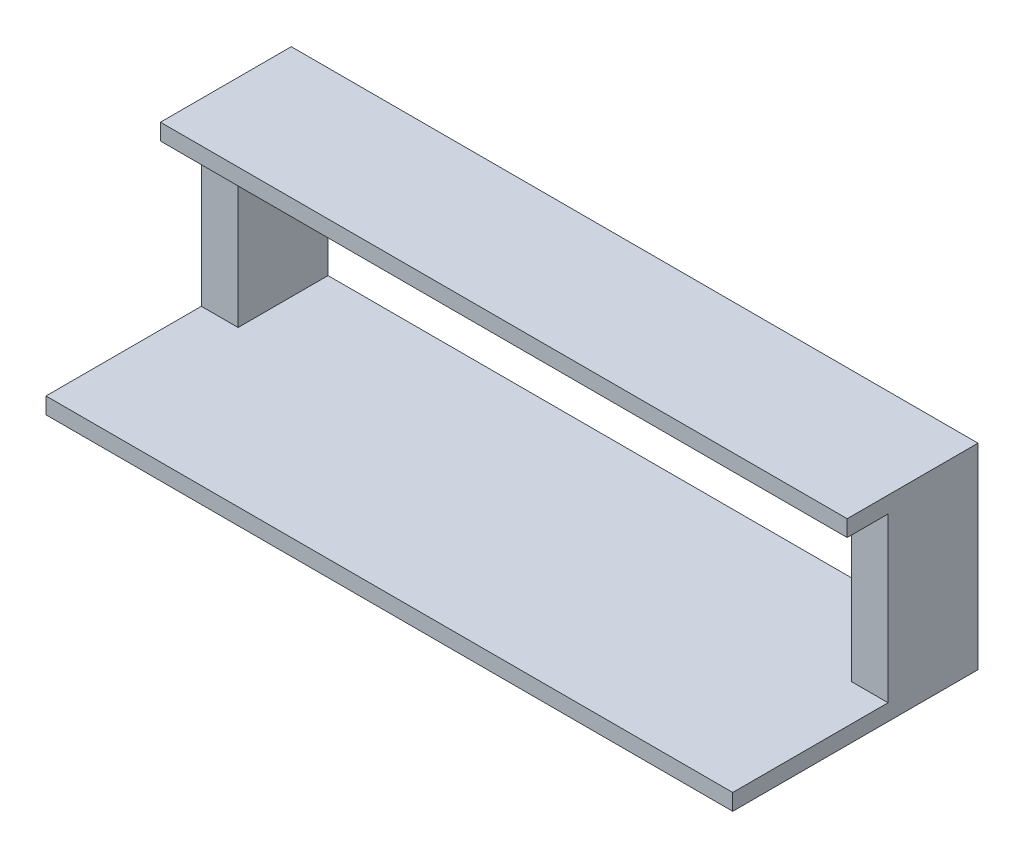
ISO-10303-21;
HEADER;
FILE_DESCRIPTION(('STEP AP214'),'2;1');
FILE_NAME('part.step','',(''),(''),'','','');
FILE_SCHEMA(('AUTOMOTIVE_DESIGN { 1 0 10303 214 1 1 1 1 }'));
ENDSEC;
DATA;
#1=APPLICATION_CONTEXT('core data for automotive mechanical design processes');
#2=APPLICATION_PROTOCOL_DEFINITION('international standard','automotive_design',2000,#1);
#3=PRODUCT_CONTEXT('',#1,'mechanical');
#4=PRODUCT('Part','Part','',(#3));
#5=PRODUCT_RELATED_PRODUCT_CATEGORY('part','',(#4));
#6=PRODUCT_DEFINITION_FORMATION('','',#4);
#7=PRODUCT_DEFINITION_CONTEXT('part definition',#1,'design');
#8=PRODUCT_DEFINITION('design','',#6,#7);
#9=PRODUCT_DEFINITION_SHAPE('','',#8);
#10=(LENGTH_UNIT() NAMED_UNIT(*) SI_UNIT(.MILLI.,.METRE.));
#11=(NAMED_UNIT(*) PLANE_ANGLE_UNIT() SI_UNIT($,.RADIAN.));
#12=(NAMED_UNIT(*) SI_UNIT($,.STERADIAN.) SOLID_ANGLE_UNIT());
#13=UNCERTAINTY_MEASURE_WITH_UNIT(LENGTH_MEASURE(1.E-05),#10,'distance_accuracy_value','');
#14=(GEOMETRIC_REPRESENTATION_CONTEXT(3) GLOBAL_UNCERTAINTY_ASSIGNED_CONTEXT((#13)) GLOBAL_UNIT_ASSIGNED_CONTEXT((#10,
#11,#12)) REPRESENTATION_CONTEXT('',''));
#15=CARTESIAN_POINT('',(0.,0.,0.));
#16=DIRECTION('',(0.,0.,1.));
#17=DIRECTION('',(1.,0.,0.));
#18=AXIS2_PLACEMENT_3D('',#15,#16,#17);
#19=CARTESIAN_POINT('',(-1066.8,558.8,-101.6));
#20=DIRECTION('',(0.,0.,-1.));
#21=DIRECTION('',(-1.,0.,0.));
#22=AXIS2_PLACEMENT_3D('',#19,#20,#21);
#23=PLANE('',#22);
#24=DIRECTION('',(1.,0.,0.));
#25=VECTOR('',#24,1.);
#26=CARTESIAN_POINT('',(-1066.8,558.8,-101.6));
#27=LINE('',#26,#25);
#28=CARTESIAN_POINT('',(-1066.8,558.8,-101.6));
#29=VERTEX_POINT('',#28);
#30=CARTESIAN_POINT('',(-952.5,558.8,-101.6));
#31=VERTEX_POINT('',#30);
#32=EDGE_CURVE('E147',#29,#31,#27,.T.);
#33=ORIENTED_EDGE('',*,*,#32,.F.);
#34=DIRECTION('',(0.,-1.,0.));
#35=VECTOR('',#34,1.);
#36=CARTESIAN_POINT('',(-1066.8,558.8,-101.6));
#37=LINE('',#36,#35);
#38=CARTESIAN_POINT('',(-1066.8,50.8,-101.6));
#39=VERTEX_POINT('',#38);
#40=EDGE_CURVE('E152',#29,#39,#37,.T.);
#41=ORIENTED_EDGE('',*,*,#40,.T.);
#42=DIRECTION('',(1.,0.,0.));
#43=VECTOR('',#42,1.);
#44=CARTESIAN_POINT('',(-1066.8,50.8,-101.6));
#45=LINE('',#44,#43);
#46=CARTESIAN_POINT('',(-952.5,50.8,-101.6));
#47=VERTEX_POINT('',#46);
#48=EDGE_CURVE('E180',#39,#47,#45,.T.);
#49=ORIENTED_EDGE('',*,*,#48,.T.);
#50=DIRECTION('',(0.,-1.,0.));
#51=VECTOR('',#50,1.);
#52=CARTESIAN_POINT('',(-952.5,558.8,-101.6));
#53=LINE('',#52,#51);
#54=EDGE_CURVE('E192',#31,#47,#53,.T.);
#55=ORIENTED_EDGE('',*,*,#54,.F.);
#56=EDGE_LOOP('',(#33,#41,#49,#55));
#57=FACE_BOUND('',#56,.T.);
#58=ADVANCED_FACE('F35',(#57),#23,.F.);
#59=CARTESIAN_POINT('',(952.499999999999,558.8,-101.6));
#60=VERTEX_POINT('',#59);
#61=CARTESIAN_POINT('',(1066.8,558.8,-101.6));
#62=VERTEX_POINT('',#61);
#63=EDGE_CURVE('E235',#60,#62,#27,.T.);
#64=ORIENTED_EDGE('',*,*,#63,.F.);
#65=DIRECTION('',(0.,-1.,0.));
#66=VECTOR('',#65,1.);
#67=CARTESIAN_POINT('',(952.5,558.8,-101.6));
#68=LINE('',#67,#66);
#69=CARTESIAN_POINT('',(952.5,50.8,-101.6));
#70=VERTEX_POINT('',#69);
#71=EDGE_CURVE('E174',#60,#70,#68,.T.);
#72=ORIENTED_EDGE('',*,*,#71,.T.);
#73=DIRECTION('',(1.,0.,0.));
#74=VECTOR('',#73,1.);
#75=CARTESIAN_POINT('',(1066.8,50.8,-101.6));
#76=LINE('',#75,#74);
#77=CARTESIAN_POINT('',(1066.8,50.8,-101.6));
#78=VERTEX_POINT('',#77);
#79=EDGE_CURVE('E50',#70,#78,#76,.T.);
#80=ORIENTED_EDGE('',*,*,#79,.T.);
#81=DIRECTION('',(0.,-1.,0.));
#82=VECTOR('',#81,1.);
#83=CARTESIAN_POINT('',(1066.8,558.8,-101.6));
#84=LINE('',#83,#82);
#85=EDGE_CURVE('E58',#62,#78,#84,.T.);
#86=ORIENTED_EDGE('',*,*,#85,.F.);
#87=EDGE_LOOP('',(#64,#72,#80,#86));
#88=FACE_BOUND('',#87,.T.);
#89=ADVANCED_FACE('F233',(#88),#23,.F.);
#90=CARTESIAN_POINT('',(0.,50.8,0.));
#91=DIRECTION('',(0.,-1.,0.));
#92=DIRECTION('',(0.,0.,-1.));
#93=AXIS2_PLACEMENT_3D('',#90,#91,#92);
#94=PLANE('',#93);
#95=DIRECTION('',(0.,0.,1.));
#96=VECTOR('',#95,1.);
#97=CARTESIAN_POINT('',(952.5,50.8,-381.));
#98=LINE('',#97,#96);
#99=CARTESIAN_POINT('',(952.5,50.8,-381.));
#100=VERTEX_POINT('',#99);
#101=EDGE_CURVE('E167',#100,#70,#98,.T.);
#102=ORIENTED_EDGE('',*,*,#101,.F.);
#103=DIRECTION('',(-1.,0.,0.));
#104=VECTOR('',#103,1.);
#105=CARTESIAN_POINT('',(-1066.8,50.8,-381.));
#106=LINE('',#105,#104);
#107=CARTESIAN_POINT('',(-952.5,50.8,-381.));
#108=VERTEX_POINT('',#107);
#109=EDGE_CURVE('E199',#100,#108,#106,.T.);
#110=ORIENTED_EDGE('',*,*,#109,.T.);
#111=DIRECTION('',(0.,0.,-1.));
#112=VECTOR('',#111,1.);
#113=CARTESIAN_POINT('',(-952.5,50.8,-381.));
#114=LINE('',#113,#112);
#115=EDGE_CURVE('E185',#47,#108,#114,.T.);
#116=ORIENTED_EDGE('',*,*,#115,.F.);
#117=ORIENTED_EDGE('',*,*,#48,.F.);
#118=DIRECTION('',(0.,0.,1.));
#119=VECTOR('',#118,1.);
#120=CARTESIAN_POINT('',(-1066.8,50.8,381.));
#121=LINE('',#120,#119);
#122=CARTESIAN_POINT('',(-1066.8,50.8,381.));
#123=VERTEX_POINT('',#122);
#124=EDGE_CURVE('E202',#39,#123,#121,.T.);
#125=ORIENTED_EDGE('',*,*,#124,.T.);
#126=DIRECTION('',(1.,0.,0.));
#127=VECTOR('',#126,1.);
#128=CARTESIAN_POINT('',(-1066.8,50.8,381.));
#129=LINE('',#128,#127);
#130=CARTESIAN_POINT('',(1066.8,50.8,381.));
#131=VERTEX_POINT('',#130);
#132=EDGE_CURVE('E204',#123,#131,#129,.T.);
#133=ORIENTED_EDGE('',*,*,#132,.T.);
#134=DIRECTION('',(0.,0.,-1.));
#135=VECTOR('',#134,1.);
#136=CARTESIAN_POINT('',(1066.8,50.8,381.));
#137=LINE('',#136,#135);
#138=EDGE_CURVE('E197',#131,#78,#137,.T.);
#139=ORIENTED_EDGE('',*,*,#138,.T.);
#140=ORIENTED_EDGE('',*,*,#79,.F.);
#141=EDGE_LOOP('',(#102,#110,#116,#117,#125,#133,#139,#140));
#142=FACE_BOUND('',#141,.T.);
#143=ADVANCED_FACE('F231',(#142),#94,.F.);
#144=CARTESIAN_POINT('',(1066.8,50.8,381.));
#145=DIRECTION('',(-1.,0.,0.));
#146=DIRECTION('',(0.,0.,1.));
#147=AXIS2_PLACEMENT_3D('',#144,#145,#146);
#148=PLANE('',#147);
#149=DIRECTION('',(0.,0.,-1.));
#150=VECTOR('',#149,1.);
#151=CARTESIAN_POINT('',(1066.8,0.,381.));
#152=LINE('',#151,#150);
#153=CARTESIAN_POINT('',(1066.8,0.,381.));
#154=VERTEX_POINT('',#153);
#155=CARTESIAN_POINT('',(1066.8,0.,-381.));
#156=VERTEX_POINT('',#155);
#157=EDGE_CURVE('E196',#154,#156,#152,.T.);
#158=ORIENTED_EDGE('',*,*,#157,.T.);
#159=DIRECTION('',(0.,-1.,0.));
#160=VECTOR('',#159,1.);
#161=CARTESIAN_POINT('',(1066.8,50.8,-381.));
#162=LINE('',#161,#160);
#163=CARTESIAN_POINT('',(1066.8,609.6,-381.));
#164=VERTEX_POINT('',#163);
#165=EDGE_CURVE('E11',#164,#156,#162,.T.);
#166=ORIENTED_EDGE('',*,*,#165,.F.);
#167=DIRECTION('',(0.,0.,-1.));
#168=VECTOR('',#167,1.);
#169=CARTESIAN_POINT('',(1066.8,609.6,-381.));
#170=LINE('',#169,#168);
#171=CARTESIAN_POINT('',(1066.8,609.6,25.4));
#172=VERTEX_POINT('',#171);
#173=EDGE_CURVE('E162',#172,#164,#170,.T.);
#174=ORIENTED_EDGE('',*,*,#173,.F.);
#175=DIRECTION('',(0.,1.,0.));
#176=VECTOR('',#175,1.);
#177=CARTESIAN_POINT('',(1066.8,609.6,25.4));
#178=LINE('',#177,#176);
#179=CARTESIAN_POINT('',(1066.8,558.8,25.4));
#180=VERTEX_POINT('',#179);
#181=EDGE_CURVE('E137',#180,#172,#178,.T.);
#182=ORIENTED_EDGE('',*,*,#181,.F.);
#183=DIRECTION('',(0.,0.,-1.));
#184=VECTOR('',#183,1.);
#185=CARTESIAN_POINT('',(1066.8,558.8,25.4));
#186=LINE('',#185,#184);
#187=EDGE_CURVE('E133',#180,#62,#186,.T.);
#188=ORIENTED_EDGE('',*,*,#187,.T.);
#189=ORIENTED_EDGE('',*,*,#85,.T.);
#190=ORIENTED_EDGE('',*,*,#138,.F.);
#191=DIRECTION('',(0.,-1.,0.));
#192=VECTOR('',#191,1.);
#193=CARTESIAN_POINT('',(1066.8,50.8,381.));
#194=LINE('',#193,#192);
#195=EDGE_CURVE('E206',#131,#154,#194,.T.);
#196=ORIENTED_EDGE('',*,*,#195,.T.);
#197=EDGE_LOOP('',(#158,#166,#174,#182,#188,#189,#190,#196));
#198=FACE_BOUND('',#197,.T.);
#199=ADVANCED_FACE('F37',(#198),#148,.F.);
#200=CARTESIAN_POINT('',(-1066.8,50.8,-381.));
#201=DIRECTION('',(0.,0.,1.));
#202=DIRECTION('',(1.,0.,0.));
#203=AXIS2_PLACEMENT_3D('',#200,#201,#202);
#204=PLANE('',#203);
#205=DIRECTION('',(0.,-1.,0.));
#206=VECTOR('',#205,1.);
#207=CARTESIAN_POINT('',(-1066.8,50.8,-381.));
#208=LINE('',#207,#206);
#209=CARTESIAN_POINT('',(-1066.8,609.6,-381.));
#210=VERTEX_POINT('',#209);
#211=CARTESIAN_POINT('',(-1066.8,0.,-381.));
#212=VERTEX_POINT('',#211);
#213=EDGE_CURVE('E43',#210,#212,#208,.T.);
#214=ORIENTED_EDGE('',*,*,#213,.F.);
#215=DIRECTION('',(-1.,0.,0.));
#216=VECTOR('',#215,1.);
#217=CARTESIAN_POINT('',(-1066.8,609.6,-381.));
#218=LINE('',#217,#216);
#219=EDGE_CURVE('E165',#164,#210,#218,.T.);
#220=ORIENTED_EDGE('',*,*,#219,.F.);
#221=ORIENTED_EDGE('',*,*,#165,.T.);
#222=DIRECTION('',(-1.,0.,0.));
#223=VECTOR('',#222,1.);
#224=CARTESIAN_POINT('',(-1066.8,0.,-381.));
#225=LINE('',#224,#223);
#226=EDGE_CURVE('E209',#156,#212,#225,.T.);
#227=ORIENTED_EDGE('',*,*,#226,.T.);
#228=EDGE_LOOP('',(#214,#220,#221,#227));
#229=FACE_BOUND('',#228,.T.);
#230=DIRECTION('',(-1.,0.,0.));
#231=VECTOR('',#230,1.);
#232=CARTESIAN_POINT('',(-1066.8,558.8,-381.));
#233=LINE('',#232,#231);
#234=CARTESIAN_POINT('',(952.499999999999,558.8,-381.));
#235=VERTEX_POINT('',#234);
#236=CARTESIAN_POINT('',(-952.5,558.8,-381.));
#237=VERTEX_POINT('',#236);
#238=EDGE_CURVE('E153',#235,#237,#233,.T.);
#239=ORIENTED_EDGE('',*,*,#238,.T.);
#240=DIRECTION('',(0.,-1.,0.));
#241=VECTOR('',#240,1.);
#242=CARTESIAN_POINT('',(-952.5,558.8,-381.));
#243=LINE('',#242,#241);
#244=EDGE_CURVE('E184',#237,#108,#243,.T.);
#245=ORIENTED_EDGE('',*,*,#244,.T.);
#246=ORIENTED_EDGE('',*,*,#109,.F.);
#247=DIRECTION('',(0.,-1.,0.));
#248=VECTOR('',#247,1.);
#249=CARTESIAN_POINT('',(952.5,558.8,-381.));
#250=LINE('',#249,#248);
#251=EDGE_CURVE('E177',#235,#100,#250,.T.);
#252=ORIENTED_EDGE('',*,*,#251,.F.);
#253=EDGE_LOOP('',(#239,#245,#246,#252));
#254=FACE_BOUND('',#253,.T.);
#255=ADVANCED_FACE('F242',(#229,#254),#204,.F.);
#256=CARTESIAN_POINT('',(-1066.8,50.8,381.));
#257=DIRECTION('',(1.,0.,0.));
#258=DIRECTION('',(0.,0.,-1.));
#259=AXIS2_PLACEMENT_3D('',#256,#257,#258);
#260=PLANE('',#259);
#261=DIRECTION('',(0.,0.,1.));
#262=VECTOR('',#261,1.);
#263=CARTESIAN_POINT('',(-1066.8,0.,381.));
#264=LINE('',#263,#262);
#265=CARTESIAN_POINT('',(-1066.8,0.,381.));
#266=VERTEX_POINT('',#265);
#267=EDGE_CURVE('E211',#212,#266,#264,.T.);
#268=ORIENTED_EDGE('',*,*,#267,.T.);
#269=DIRECTION('',(0.,-1.,0.));
#270=VECTOR('',#269,1.);
#271=CARTESIAN_POINT('',(-1066.8,50.8,381.));
#272=LINE('',#271,#270);
#273=EDGE_CURVE('E216',#123,#266,#272,.T.);
#274=ORIENTED_EDGE('',*,*,#273,.F.);
#275=ORIENTED_EDGE('',*,*,#124,.F.);
#276=ORIENTED_EDGE('',*,*,#40,.F.);
#277=DIRECTION('',(0.,0.,-1.));
#278=VECTOR('',#277,1.);
#279=CARTESIAN_POINT('',(-1066.8,558.8,25.4));
#280=LINE('',#279,#278);
#281=CARTESIAN_POINT('',(-1066.8,558.8,25.4));
#282=VERTEX_POINT('',#281);
#283=EDGE_CURVE('E131',#282,#29,#280,.T.);
#284=ORIENTED_EDGE('',*,*,#283,.F.);
#285=DIRECTION('',(0.,-1.,0.));
#286=VECTOR('',#285,1.);
#287=CARTESIAN_POINT('',(-1066.8,609.6,25.4));
#288=LINE('',#287,#286);
#289=CARTESIAN_POINT('',(-1066.8,609.6,25.4));
#290=VERTEX_POINT('',#289);
#291=EDGE_CURVE('E138',#290,#282,#288,.T.);
#292=ORIENTED_EDGE('',*,*,#291,.F.);
#293=DIRECTION('',(0.,0.,1.));
#294=VECTOR('',#293,1.);
#295=CARTESIAN_POINT('',(-1066.8,609.6,-381.));
#296=LINE('',#295,#294);
#297=EDGE_CURVE('E156',#210,#290,#296,.T.);
#298=ORIENTED_EDGE('',*,*,#297,.F.);
#299=ORIENTED_EDGE('',*,*,#213,.T.);
#300=EDGE_LOOP('',(#268,#274,#275,#276,#284,#292,#298,#299));
#301=FACE_BOUND('',#300,.T.);
#302=ADVANCED_FACE('F150',(#301),#260,.F.);
#303=CARTESIAN_POINT('',(-1066.8,50.8,381.));
#304=DIRECTION('',(0.,0.,-1.));
#305=DIRECTION('',(-1.,0.,0.));
#306=AXIS2_PLACEMENT_3D('',#303,#304,#305);
#307=PLANE('',#306);
#308=DIRECTION('',(1.,0.,0.));
#309=VECTOR('',#308,1.);
#310=CARTESIAN_POINT('',(-1066.8,0.,381.));
#311=LINE('',#310,#309);
#312=EDGE_CURVE('E200',#266,#154,#311,.T.);
#313=ORIENTED_EDGE('',*,*,#312,.T.);
#314=ORIENTED_EDGE('',*,*,#195,.F.);
#315=ORIENTED_EDGE('',*,*,#132,.F.);
#316=ORIENTED_EDGE('',*,*,#273,.T.);
#317=EDGE_LOOP('',(#313,#314,#315,#316));
#318=FACE_BOUND('',#317,.T.);
#319=ADVANCED_FACE('F229',(#318),#307,.F.);
#320=CARTESIAN_POINT('',(0.,0.,0.));
#321=DIRECTION('',(0.,-1.,0.));
#322=DIRECTION('',(0.,0.,-1.));
#323=AXIS2_PLACEMENT_3D('',#320,#321,#322);
#324=PLANE('',#323);
#325=ORIENTED_EDGE('',*,*,#157,.F.);
#326=ORIENTED_EDGE('',*,*,#312,.F.);
#327=ORIENTED_EDGE('',*,*,#267,.F.);
#328=ORIENTED_EDGE('',*,*,#226,.F.);
#329=EDGE_LOOP('',(#325,#326,#327,#328));
#330=FACE_BOUND('',#329,.T.);
#331=ADVANCED_FACE('F226',(#330),#324,.T.);
#332=CARTESIAN_POINT('',(-952.5,558.8,-381.));
#333=DIRECTION('',(-1.,0.,0.));
#334=DIRECTION('',(0.,0.,1.));
#335=AXIS2_PLACEMENT_3D('',#332,#333,#334);
#336=PLANE('',#335);
#337=ORIENTED_EDGE('',*,*,#115,.T.);
#338=ORIENTED_EDGE('',*,*,#244,.F.);
#339=DIRECTION('',(0.,0.,-1.));
#340=VECTOR('',#339,1.);
#341=CARTESIAN_POINT('',(-952.5,558.8,-381.));
#342=LINE('',#341,#340);
#343=EDGE_CURVE('E181',#31,#237,#342,.T.);
#344=ORIENTED_EDGE('',*,*,#343,.F.);
#345=ORIENTED_EDGE('',*,*,#54,.T.);
#346=EDGE_LOOP('',(#337,#338,#344,#345));
#347=FACE_BOUND('',#346,.T.);
#348=ADVANCED_FACE('F245',(#347),#336,.F.);
#349=CARTESIAN_POINT('',(952.5,558.8,-381.));
#350=DIRECTION('',(1.,0.,0.));
#351=DIRECTION('',(0.,0.,-1.));
#352=AXIS2_PLACEMENT_3D('',#349,#350,#351);
#353=PLANE('',#352);
#354=ORIENTED_EDGE('',*,*,#101,.T.);
#355=ORIENTED_EDGE('',*,*,#71,.F.);
#356=DIRECTION('',(0.,0.,1.));
#357=VECTOR('',#356,1.);
#358=CARTESIAN_POINT('',(952.5,558.8,-381.));
#359=LINE('',#358,#357);
#360=EDGE_CURVE('E169',#235,#60,#359,.T.);
#361=ORIENTED_EDGE('',*,*,#360,.F.);
#362=ORIENTED_EDGE('',*,*,#251,.T.);
#363=EDGE_LOOP('',(#354,#355,#361,#362));
#364=FACE_BOUND('',#363,.T.);
#365=ADVANCED_FACE('F237',(#364),#353,.F.);
#366=CARTESIAN_POINT('',(0.,558.8,0.));
#367=DIRECTION('',(0.,1.,0.));
#368=DIRECTION('',(0.,0.,1.));
#369=AXIS2_PLACEMENT_3D('',#366,#367,#368);
#370=PLANE('',#369);
#371=ORIENTED_EDGE('',*,*,#360,.T.);
#372=ORIENTED_EDGE('',*,*,#63,.T.);
#373=ORIENTED_EDGE('',*,*,#187,.F.);
#374=DIRECTION('',(1.,0.,0.));
#375=VECTOR('',#374,1.);
#376=CARTESIAN_POINT('',(-1066.8,558.8,25.4));
#377=LINE('',#376,#375);
#378=EDGE_CURVE('E126',#282,#180,#377,.T.);
#379=ORIENTED_EDGE('',*,*,#378,.F.);
#380=ORIENTED_EDGE('',*,*,#283,.T.);
#381=ORIENTED_EDGE('',*,*,#32,.T.);
#382=ORIENTED_EDGE('',*,*,#343,.T.);
#383=ORIENTED_EDGE('',*,*,#238,.F.);
#384=EDGE_LOOP('',(#371,#372,#373,#379,#380,#381,#382,#383));
#385=FACE_BOUND('',#384,.T.);
#386=ADVANCED_FACE('F129',(#385),#370,.F.);
#387=CARTESIAN_POINT('',(0.,609.6,0.));
#388=DIRECTION('',(0.,1.,0.));
#389=DIRECTION('',(0.,0.,1.));
#390=AXIS2_PLACEMENT_3D('',#387,#388,#389);
#391=PLANE('',#390);
#392=ORIENTED_EDGE('',*,*,#297,.T.);
#393=DIRECTION('',(-1.,0.,0.));
#394=VECTOR('',#393,1.);
#395=CARTESIAN_POINT('',(-1066.8,609.6,25.4));
#396=LINE('',#395,#394);
#397=EDGE_CURVE('E144',#172,#290,#396,.T.);
#398=ORIENTED_EDGE('',*,*,#397,.F.);
#399=ORIENTED_EDGE('',*,*,#173,.T.);
#400=ORIENTED_EDGE('',*,*,#219,.T.);
#401=EDGE_LOOP('',(#392,#398,#399,#400));
#402=FACE_BOUND('',#401,.T.);
#403=ADVANCED_FACE('F251',(#402),#391,.T.);
#404=CARTESIAN_POINT('',(0.,0.,25.4));
#405=DIRECTION('',(0.,0.,1.));
#406=DIRECTION('',(1.,0.,0.));
#407=AXIS2_PLACEMENT_3D('',#404,#405,#406);
#408=PLANE('',#407);
#409=ORIENTED_EDGE('',*,*,#291,.T.);
#410=ORIENTED_EDGE('',*,*,#378,.T.);
#411=ORIENTED_EDGE('',*,*,#181,.T.);
#412=ORIENTED_EDGE('',*,*,#397,.T.);
#413=EDGE_LOOP('',(#409,#410,#411,#412));
#414=FACE_BOUND('',#413,.T.);
#415=ADVANCED_FACE('F142',(#414),#408,.T.);
#416=CLOSED_SHELL('',(#58,#89,#143,#199,#255,#302,#319,#331,#348,#365,#386,#403,#415));
#417=MANIFOLD_SOLID_BREP('B2',#416);
#418=ADVANCED_BREP_SHAPE_REPRESENTATION('',(#18,#417),#14);
#419=SHAPE_DEFINITION_REPRESENTATION(#9,#418);
ENDSEC;
END-ISO-10303-21;
